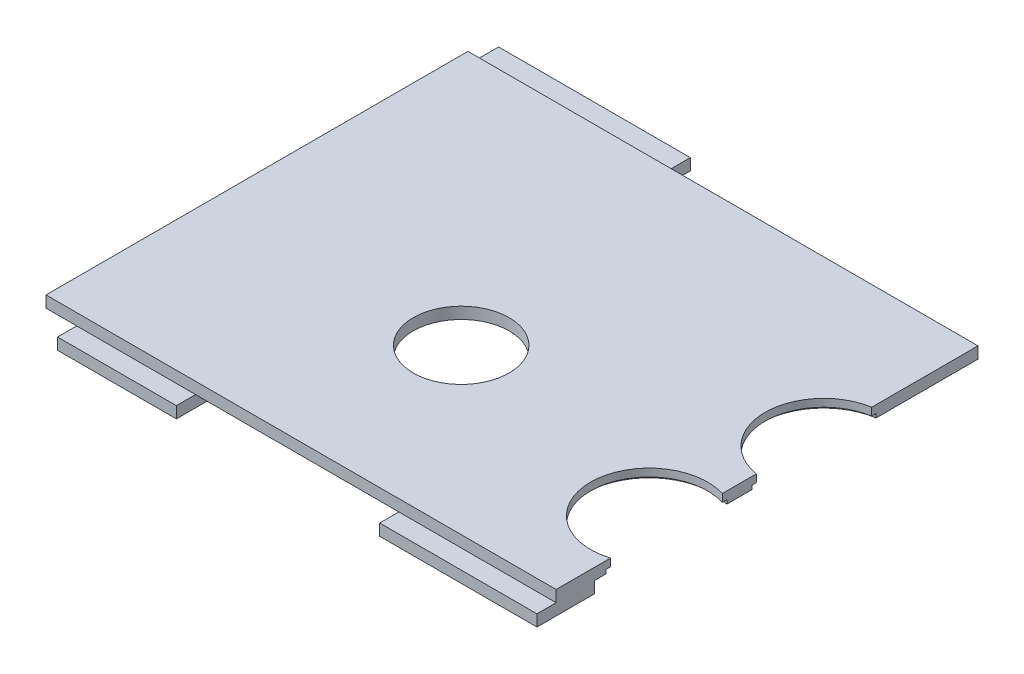
ISO-10303-21;
HEADER;
FILE_DESCRIPTION(('STEP AP214'),'2;1');
FILE_NAME('part.step','',(''),(''),'','','');
FILE_SCHEMA(('AUTOMOTIVE_DESIGN { 1 0 10303 214 1 1 1 1 }'));
ENDSEC;
DATA;
#1=APPLICATION_CONTEXT('core data for automotive mechanical design processes');
#2=APPLICATION_PROTOCOL_DEFINITION('international standard','automotive_design',2000,#1);
#3=PRODUCT_CONTEXT('',#1,'mechanical');
#4=PRODUCT('Part','Part','',(#3));
#5=PRODUCT_RELATED_PRODUCT_CATEGORY('part','',(#4));
#6=PRODUCT_DEFINITION_FORMATION('','',#4);
#7=PRODUCT_DEFINITION_CONTEXT('part definition',#1,'design');
#8=PRODUCT_DEFINITION('design','',#6,#7);
#9=PRODUCT_DEFINITION_SHAPE('','',#8);
#10=(LENGTH_UNIT() NAMED_UNIT(*) SI_UNIT(.MILLI.,.METRE.));
#11=(NAMED_UNIT(*) PLANE_ANGLE_UNIT() SI_UNIT($,.RADIAN.));
#12=(NAMED_UNIT(*) SI_UNIT($,.STERADIAN.) SOLID_ANGLE_UNIT());
#13=UNCERTAINTY_MEASURE_WITH_UNIT(LENGTH_MEASURE(1.E-05),#10,'distance_accuracy_value','');
#14=(GEOMETRIC_REPRESENTATION_CONTEXT(3) GLOBAL_UNCERTAINTY_ASSIGNED_CONTEXT((#13)) GLOBAL_UNIT_ASSIGNED_CONTEXT((#10,
#11,#12)) REPRESENTATION_CONTEXT('',''));
#15=CARTESIAN_POINT('',(0.,0.,0.));
#16=DIRECTION('',(0.,0.,1.));
#17=DIRECTION('',(1.,0.,0.));
#18=AXIS2_PLACEMENT_3D('',#15,#16,#17);
#19=CARTESIAN_POINT('',(135.5,-3.001,-67.25));
#20=DIRECTION('',(0.,1.,0.));
#21=DIRECTION('',(0.,0.,1.));
#22=AXIS2_PLACEMENT_3D('',#19,#20,#21);
#23=CYLINDRICAL_SURFACE('',#22,15.25);
#24=CARTESIAN_POINT('',(135.5,1.,-67.25));
#25=DIRECTION('',(0.,-1.,0.));
#26=DIRECTION('',(0.,0.,-1.));
#27=AXIS2_PLACEMENT_3D('',#24,#25,#26);
#28=CIRCLE('',#27,15.25);
#29=CARTESIAN_POINT('',(133.,0.999999999999998,-82.2936863833304));
#30=VERTEX_POINT('',#29);
#31=CARTESIAN_POINT('',(133.,1.,-52.2063136166696));
#32=VERTEX_POINT('',#31);
#33=EDGE_CURVE('E42',#30,#32,#28,.F.);
#34=ORIENTED_EDGE('',*,*,#33,.F.);
#35=DIRECTION('',(0.,1.,0.));
#36=VECTOR('',#35,1.);
#37=CARTESIAN_POINT('',(133.,-3.001,-82.2936863833304));
#38=LINE('',#37,#36);
#39=CARTESIAN_POINT('',(133.,3.,-82.2936863833304));
#40=VERTEX_POINT('',#39);
#41=EDGE_CURVE('E279',#30,#40,#38,.T.);
#42=ORIENTED_EDGE('',*,*,#41,.T.);
#43=CARTESIAN_POINT('',(135.5,3.,-67.25));
#44=DIRECTION('',(0.,1.,0.));
#45=DIRECTION('',(0.,0.,1.));
#46=AXIS2_PLACEMENT_3D('',#43,#44,#45);
#47=CIRCLE('',#46,15.25);
#48=CARTESIAN_POINT('',(133.,3.,-52.2063136166696));
#49=VERTEX_POINT('',#48);
#50=EDGE_CURVE('E278',#40,#49,#47,.T.);
#51=ORIENTED_EDGE('',*,*,#50,.T.);
#52=DIRECTION('',(0.,1.,0.));
#53=VECTOR('',#52,1.);
#54=CARTESIAN_POINT('',(133.,-3.001,-52.2063136166696));
#55=LINE('',#54,#53);
#56=EDGE_CURVE('E274',#49,#32,#55,.F.);
#57=ORIENTED_EDGE('',*,*,#56,.T.);
#58=EDGE_LOOP('',(#34,#42,#51,#57));
#59=FACE_BOUND('',#58,.T.);
#60=ADVANCED_FACE('F34',(#59),#23,.F.);
#61=CARTESIAN_POINT('',(128.5,-3.001,-28.75));
#62=DIRECTION('',(0.,1.,0.));
#63=DIRECTION('',(0.,0.,1.));
#64=AXIS2_PLACEMENT_3D('',#61,#62,#63);
#65=CYLINDRICAL_SURFACE('',#64,15.25);
#66=CARTESIAN_POINT('',(128.5,1.,-28.75));
#67=DIRECTION('',(0.,-1.,0.));
#68=DIRECTION('',(0.,0.,-1.));
#69=AXIS2_PLACEMENT_3D('',#66,#67,#68);
#70=CIRCLE('',#69,15.25);
#71=CARTESIAN_POINT('',(133.,0.999999999999998,-43.3209471208978));
#72=VERTEX_POINT('',#71);
#73=CARTESIAN_POINT('',(133.,1.,-14.1790528791022));
#74=VERTEX_POINT('',#73);
#75=EDGE_CURVE('E264',#72,#74,#70,.F.);
#76=ORIENTED_EDGE('',*,*,#75,.F.);
#77=DIRECTION('',(0.,1.,0.));
#78=VECTOR('',#77,1.);
#79=CARTESIAN_POINT('',(133.,-3.001,-43.3209471208978));
#80=LINE('',#79,#78);
#81=CARTESIAN_POINT('',(133.,3.,-43.3209471208978));
#82=VERTEX_POINT('',#81);
#83=EDGE_CURVE('E281',#72,#82,#80,.T.);
#84=ORIENTED_EDGE('',*,*,#83,.T.);
#85=CARTESIAN_POINT('',(128.5,3.,-28.75));
#86=DIRECTION('',(0.,1.,0.));
#87=DIRECTION('',(0.,0.,1.));
#88=AXIS2_PLACEMENT_3D('',#85,#86,#87);
#89=CIRCLE('',#88,15.25);
#90=CARTESIAN_POINT('',(133.,3.,-14.1790528791022));
#91=VERTEX_POINT('',#90);
#92=EDGE_CURVE('E551',#82,#91,#89,.T.);
#93=ORIENTED_EDGE('',*,*,#92,.T.);
#94=DIRECTION('',(0.,1.,0.));
#95=VECTOR('',#94,1.);
#96=CARTESIAN_POINT('',(133.,-3.001,-14.1790528791022));
#97=LINE('',#96,#95);
#98=EDGE_CURVE('E552',#91,#74,#97,.F.);
#99=ORIENTED_EDGE('',*,*,#98,.T.);
#100=EDGE_LOOP('',(#76,#84,#93,#99));
#101=FACE_BOUND('',#100,.T.);
#102=ADVANCED_FACE('F439',(#101),#65,.F.);
#103=CARTESIAN_POINT('',(133.,3.,0.));
#104=DIRECTION('',(-1.,0.,0.));
#105=DIRECTION('',(0.,0.,1.));
#106=AXIS2_PLACEMENT_3D('',#103,#104,#105);
#107=PLANE('',#106);
#108=DIRECTION('',(0.,0.,-1.));
#109=VECTOR('',#108,1.);
#110=CARTESIAN_POINT('',(133.,0.,0.));
#111=LINE('',#110,#109);
#112=CARTESIAN_POINT('',(133.,0.,-10.));
#113=VERTEX_POINT('',#112);
#114=CARTESIAN_POINT('',(133.,0.,-13.0054572946687));
#115=VERTEX_POINT('',#114);
#116=EDGE_CURVE('E235',#113,#115,#111,.T.);
#117=ORIENTED_EDGE('',*,*,#116,.T.);
#118=DIRECTION('',(0.,-1.,0.));
#119=VECTOR('',#118,1.);
#120=CARTESIAN_POINT('',(133.,1.,-13.0054572946687));
#121=LINE('',#120,#119);
#122=CARTESIAN_POINT('',(133.,1.,-13.0054572946687));
#123=VERTEX_POINT('',#122);
#124=EDGE_CURVE('E214',#115,#123,#121,.F.);
#125=ORIENTED_EDGE('',*,*,#124,.T.);
#126=DIRECTION('',(0.,0.,1.));
#127=VECTOR('',#126,1.);
#128=CARTESIAN_POINT('',(133.,1.,0.));
#129=LINE('',#128,#127);
#130=EDGE_CURVE('E569',#74,#123,#129,.T.);
#131=ORIENTED_EDGE('',*,*,#130,.F.);
#132=ORIENTED_EDGE('',*,*,#98,.F.);
#133=DIRECTION('',(0.,0.,-1.));
#134=VECTOR('',#133,1.);
#135=CARTESIAN_POINT('',(133.,3.,0.));
#136=LINE('',#135,#134);
#137=CARTESIAN_POINT('',(133.,3.,0.));
#138=VERTEX_POINT('',#137);
#139=EDGE_CURVE('E386',#138,#91,#136,.T.);
#140=ORIENTED_EDGE('',*,*,#139,.F.);
#141=DIRECTION('',(0.,-1.,0.));
#142=VECTOR('',#141,1.);
#143=CARTESIAN_POINT('',(133.,3.,0.));
#144=LINE('',#143,#142);
#145=CARTESIAN_POINT('',(133.,0.,0.));
#146=VERTEX_POINT('',#145);
#147=EDGE_CURVE('E254',#138,#146,#144,.T.);
#148=ORIENTED_EDGE('',*,*,#147,.T.);
#149=DIRECTION('',(0.,0.,1.));
#150=VECTOR('',#149,1.);
#151=CARTESIAN_POINT('',(133.,0.,-10.));
#152=LINE('',#151,#150);
#153=CARTESIAN_POINT('',(133.,0.,5.));
#154=VERTEX_POINT('',#153);
#155=EDGE_CURVE('E320',#146,#154,#152,.T.);
#156=ORIENTED_EDGE('',*,*,#155,.T.);
#157=DIRECTION('',(0.,1.,0.));
#158=VECTOR('',#157,1.);
#159=CARTESIAN_POINT('',(133.,-3.,5.));
#160=LINE('',#159,#158);
#161=CARTESIAN_POINT('',(133.,-3.,5.));
#162=VERTEX_POINT('',#161);
#163=EDGE_CURVE('E346',#162,#154,#160,.T.);
#164=ORIENTED_EDGE('',*,*,#163,.F.);
#165=DIRECTION('',(0.,0.,1.));
#166=VECTOR('',#165,1.);
#167=CARTESIAN_POINT('',(133.,-3.,-10.));
#168=LINE('',#167,#166);
#169=CARTESIAN_POINT('',(133.,-3.,-10.));
#170=VERTEX_POINT('',#169);
#171=EDGE_CURVE('E321',#170,#162,#168,.T.);
#172=ORIENTED_EDGE('',*,*,#171,.F.);
#173=DIRECTION('',(0.,1.,0.));
#174=VECTOR('',#173,1.);
#175=CARTESIAN_POINT('',(133.,-3.,-10.));
#176=LINE('',#175,#174);
#177=EDGE_CURVE('E331',#170,#113,#176,.T.);
#178=ORIENTED_EDGE('',*,*,#177,.T.);
#179=EDGE_LOOP('',(#117,#125,#131,#132,#140,#148,#156,#164,#172,#178));
#180=FACE_BOUND('',#179,.T.);
#181=ADVANCED_FACE('F445',(#180),#107,.F.);
#182=DIRECTION('',(0.,0.,1.));
#183=VECTOR('',#182,1.);
#184=CARTESIAN_POINT('',(133.,1.,0.));
#185=LINE('',#184,#183);
#186=CARTESIAN_POINT('',(133.,1.,-44.4945427053313));
#187=VERTEX_POINT('',#186);
#188=EDGE_CURVE('E57',#187,#72,#185,.T.);
#189=ORIENTED_EDGE('',*,*,#188,.F.);
#190=DIRECTION('',(0.,-1.,0.));
#191=VECTOR('',#190,1.);
#192=CARTESIAN_POINT('',(133.,1.,-44.4945427053313));
#193=LINE('',#192,#191);
#194=CARTESIAN_POINT('',(133.,0.,-44.4945427053313));
#195=VERTEX_POINT('',#194);
#196=EDGE_CURVE('E212',#187,#195,#193,.T.);
#197=ORIENTED_EDGE('',*,*,#196,.T.);
#198=CARTESIAN_POINT('',(133.,0.,-51.0669649014779));
#199=VERTEX_POINT('',#198);
#200=EDGE_CURVE('E226',#195,#199,#111,.T.);
#201=ORIENTED_EDGE('',*,*,#200,.T.);
#202=DIRECTION('',(0.,-1.,0.));
#203=VECTOR('',#202,1.);
#204=CARTESIAN_POINT('',(133.,1.,-51.0669649014779));
#205=LINE('',#204,#203);
#206=CARTESIAN_POINT('',(133.,1.,-51.0669649014779));
#207=VERTEX_POINT('',#206);
#208=EDGE_CURVE('E228',#199,#207,#205,.F.);
#209=ORIENTED_EDGE('',*,*,#208,.T.);
#210=DIRECTION('',(0.,0.,1.));
#211=VECTOR('',#210,1.);
#212=CARTESIAN_POINT('',(133.,1.,0.));
#213=LINE('',#212,#211);
#214=EDGE_CURVE('E267',#32,#207,#213,.T.);
#215=ORIENTED_EDGE('',*,*,#214,.F.);
#216=ORIENTED_EDGE('',*,*,#56,.F.);
#217=EDGE_CURVE('E389',#82,#49,#136,.T.);
#218=ORIENTED_EDGE('',*,*,#217,.F.);
#219=ORIENTED_EDGE('',*,*,#83,.F.);
#220=EDGE_LOOP('',(#189,#197,#201,#209,#215,#216,#218,#219));
#221=FACE_BOUND('',#220,.T.);
#222=ADVANCED_FACE('F224',(#221),#107,.F.);
#223=CARTESIAN_POINT('',(0.,0.,0.));
#224=DIRECTION('',(0.,-1.,0.));
#225=DIRECTION('',(0.,0.,-1.));
#226=AXIS2_PLACEMENT_3D('',#223,#224,#225);
#227=PLANE('',#226);
#228=CARTESIAN_POINT('',(128.5,0.,-28.75));
#229=DIRECTION('',(0.,-1.,0.));
#230=DIRECTION('',(0.,0.,-1.));
#231=AXIS2_PLACEMENT_3D('',#228,#229,#230);
#232=CIRCLE('',#231,16.375);
#233=EDGE_CURVE('E208',#115,#195,#232,.T.);
#234=ORIENTED_EDGE('',*,*,#233,.F.);
#235=ORIENTED_EDGE('',*,*,#116,.F.);
#236=DIRECTION('',(1.,0.,0.));
#237=VECTOR('',#236,1.);
#238=CARTESIAN_POINT('',(133.,0.,-10.));
#239=LINE('',#238,#237);
#240=CARTESIAN_POINT('',(92.,0.,-10.));
#241=VERTEX_POINT('',#240);
#242=EDGE_CURVE('E325',#241,#113,#239,.T.);
#243=ORIENTED_EDGE('',*,*,#242,.F.);
#244=DIRECTION('',(0.,0.,1.));
#245=VECTOR('',#244,1.);
#246=CARTESIAN_POINT('',(92.,0.,0.));
#247=LINE('',#246,#245);
#248=CARTESIAN_POINT('',(92.,0.,0.));
#249=VERTEX_POINT('',#248);
#250=EDGE_CURVE('E261',#241,#249,#247,.T.);
#251=ORIENTED_EDGE('',*,*,#250,.T.);
#252=DIRECTION('',(1.,0.,0.));
#253=VECTOR('',#252,1.);
#254=CARTESIAN_POINT('',(0.,0.,0.));
#255=LINE('',#254,#253);
#256=CARTESIAN_POINT('',(39.,0.,0.));
#257=VERTEX_POINT('',#256);
#258=EDGE_CURVE('E395',#257,#249,#255,.T.);
#259=ORIENTED_EDGE('',*,*,#258,.F.);
#260=DIRECTION('',(0.,0.,1.));
#261=VECTOR('',#260,1.);
#262=CARTESIAN_POINT('',(39.,0.,-10.));
#263=LINE('',#262,#261);
#264=CARTESIAN_POINT('',(39.,0.,-10.));
#265=VERTEX_POINT('',#264);
#266=EDGE_CURVE('E290',#265,#257,#263,.T.);
#267=ORIENTED_EDGE('',*,*,#266,.F.);
#268=DIRECTION('',(1.,0.,0.));
#269=VECTOR('',#268,1.);
#270=CARTESIAN_POINT('',(39.,0.,-10.));
#271=LINE('',#270,#269);
#272=CARTESIAN_POINT('',(8.00000000000001,0.,-10.));
#273=VERTEX_POINT('',#272);
#274=EDGE_CURVE('E305',#273,#265,#271,.T.);
#275=ORIENTED_EDGE('',*,*,#274,.F.);
#276=DIRECTION('',(0.,0.,-1.));
#277=VECTOR('',#276,1.);
#278=CARTESIAN_POINT('',(8.00000000000001,0.,-10.));
#279=LINE('',#278,#277);
#280=CARTESIAN_POINT('',(8.00000000000001,0.,0.));
#281=VERTEX_POINT('',#280);
#282=EDGE_CURVE('E300',#281,#273,#279,.T.);
#283=ORIENTED_EDGE('',*,*,#282,.F.);
#284=CARTESIAN_POINT('',(0.,0.,0.));
#285=VERTEX_POINT('',#284);
#286=EDGE_CURVE('E239',#285,#281,#255,.T.);
#287=ORIENTED_EDGE('',*,*,#286,.F.);
#288=DIRECTION('',(0.,0.,1.));
#289=VECTOR('',#288,1.);
#290=CARTESIAN_POINT('',(0.,0.,0.));
#291=LINE('',#290,#289);
#292=CARTESIAN_POINT('',(0.,0.,-100.));
#293=VERTEX_POINT('',#292);
#294=EDGE_CURVE('E380',#293,#285,#291,.T.);
#295=ORIENTED_EDGE('',*,*,#294,.F.);
#296=DIRECTION('',(-1.,0.,0.));
#297=VECTOR('',#296,1.);
#298=CARTESIAN_POINT('',(0.,0.,-100.));
#299=LINE('',#298,#297);
#300=CARTESIAN_POINT('',(50.,0.,-100.));
#301=VERTEX_POINT('',#300);
#302=EDGE_CURVE('E354',#301,#293,#299,.T.);
#303=ORIENTED_EDGE('',*,*,#302,.F.);
#304=DIRECTION('',(0.,0.,1.));
#305=VECTOR('',#304,1.);
#306=CARTESIAN_POINT('',(50.,0.,-118.));
#307=LINE('',#306,#305);
#308=CARTESIAN_POINT('',(50.,0.,-110.));
#309=VERTEX_POINT('',#308);
#310=EDGE_CURVE('E260',#309,#301,#307,.T.);
#311=ORIENTED_EDGE('',*,*,#310,.F.);
#312=DIRECTION('',(-1.,0.,0.));
#313=VECTOR('',#312,1.);
#314=CARTESIAN_POINT('',(0.,0.,-110.));
#315=LINE('',#314,#313);
#316=CARTESIAN_POINT('',(133.,0.,-110.));
#317=VERTEX_POINT('',#316);
#318=EDGE_CURVE('E243',#317,#309,#315,.T.);
#319=ORIENTED_EDGE('',*,*,#318,.F.);
#320=CARTESIAN_POINT('',(133.,0.,-83.4330350985222));
#321=VERTEX_POINT('',#320);
#322=EDGE_CURVE('E236',#321,#317,#111,.T.);
#323=ORIENTED_EDGE('',*,*,#322,.F.);
#324=CARTESIAN_POINT('',(135.5,0.,-67.25));
#325=DIRECTION('',(0.,-1.,0.));
#326=DIRECTION('',(0.,0.,-1.));
#327=AXIS2_PLACEMENT_3D('',#324,#325,#326);
#328=CIRCLE('',#327,16.375);
#329=EDGE_CURVE('E234',#199,#321,#328,.T.);
#330=ORIENTED_EDGE('',*,*,#329,.F.);
#331=ORIENTED_EDGE('',*,*,#200,.F.);
#332=EDGE_LOOP('',(#234,#235,#243,#251,#259,#267,#275,#283,#287,#295,#303,#311,#319,#323,#330,#331));
#333=FACE_BOUND('',#332,.T.);
#334=CARTESIAN_POINT('',(65.5,0.,-42.75));
#335=DIRECTION('',(0.,-1.,0.));
#336=DIRECTION('',(0.,0.,-1.));
#337=AXIS2_PLACEMENT_3D('',#334,#335,#336);
#338=CIRCLE('',#337,12.5);
#339=CARTESIAN_POINT('',(65.5,0.,-55.25));
#340=VERTEX_POINT('',#339);
#341=EDGE_CURVE('E557',#340,#340,#338,.F.);
#342=ORIENTED_EDGE('',*,*,#341,.T.);
#343=EDGE_LOOP('',(#342));
#344=FACE_BOUND('',#343,.T.);
#345=ADVANCED_FACE('F231',(#333,#344),#227,.T.);
#346=CARTESIAN_POINT('',(0.,3.,0.));
#347=DIRECTION('',(1.,0.,0.));
#348=DIRECTION('',(0.,0.,-1.));
#349=AXIS2_PLACEMENT_3D('',#346,#347,#348);
#350=PLANE('',#349);
#351=DIRECTION('',(0.,-1.,0.));
#352=VECTOR('',#351,1.);
#353=CARTESIAN_POINT('',(0.,3.,-110.));
#354=LINE('',#353,#352);
#355=CARTESIAN_POINT('',(0.,3.,-110.));
#356=VERTEX_POINT('',#355);
#357=CARTESIAN_POINT('',(0.,0.,-110.));
#358=VERTEX_POINT('',#357);
#359=EDGE_CURVE('E247',#356,#358,#354,.T.);
#360=ORIENTED_EDGE('',*,*,#359,.T.);
#361=DIRECTION('',(0.,0.,-1.));
#362=VECTOR('',#361,1.);
#363=CARTESIAN_POINT('',(0.,0.,-118.));
#364=LINE('',#363,#362);
#365=CARTESIAN_POINT('',(0.,0.,-118.));
#366=VERTEX_POINT('',#365);
#367=EDGE_CURVE('E349',#358,#366,#364,.T.);
#368=ORIENTED_EDGE('',*,*,#367,.T.);
#369=DIRECTION('',(0.,1.,0.));
#370=VECTOR('',#369,1.);
#371=CARTESIAN_POINT('',(0.,-3.,-118.));
#372=LINE('',#371,#370);
#373=CARTESIAN_POINT('',(0.,-3.,-118.));
#374=VERTEX_POINT('',#373);
#375=EDGE_CURVE('E377',#374,#366,#372,.T.);
#376=ORIENTED_EDGE('',*,*,#375,.F.);
#377=DIRECTION('',(0.,0.,-1.));
#378=VECTOR('',#377,1.);
#379=CARTESIAN_POINT('',(0.,-3.,-118.));
#380=LINE('',#379,#378);
#381=CARTESIAN_POINT('',(0.,-3.,-100.));
#382=VERTEX_POINT('',#381);
#383=EDGE_CURVE('E350',#382,#374,#380,.T.);
#384=ORIENTED_EDGE('',*,*,#383,.F.);
#385=DIRECTION('',(0.,1.,0.));
#386=VECTOR('',#385,1.);
#387=CARTESIAN_POINT('',(0.,-3.,-100.));
#388=LINE('',#387,#386);
#389=EDGE_CURVE('E360',#382,#293,#388,.T.);
#390=ORIENTED_EDGE('',*,*,#389,.T.);
#391=ORIENTED_EDGE('',*,*,#294,.T.);
#392=DIRECTION('',(0.,-1.,0.));
#393=VECTOR('',#392,1.);
#394=CARTESIAN_POINT('',(0.,3.,0.));
#395=LINE('',#394,#393);
#396=CARTESIAN_POINT('',(0.,3.,0.));
#397=VERTEX_POINT('',#396);
#398=EDGE_CURVE('E257',#397,#285,#395,.T.);
#399=ORIENTED_EDGE('',*,*,#398,.F.);
#400=DIRECTION('',(0.,0.,1.));
#401=VECTOR('',#400,1.);
#402=CARTESIAN_POINT('',(0.,3.,0.));
#403=LINE('',#402,#401);
#404=EDGE_CURVE('E246',#356,#397,#403,.T.);
#405=ORIENTED_EDGE('',*,*,#404,.F.);
#406=EDGE_LOOP('',(#360,#368,#376,#384,#390,#391,#399,#405));
#407=FACE_BOUND('',#406,.T.);
#408=ADVANCED_FACE('F36',(#407),#350,.F.);
#409=CARTESIAN_POINT('',(0.,3.,0.));
#410=DIRECTION('',(0.,0.,-1.));
#411=DIRECTION('',(-1.,0.,0.));
#412=AXIS2_PLACEMENT_3D('',#409,#410,#411);
#413=PLANE('',#412);
#414=ORIENTED_EDGE('',*,*,#286,.T.);
#415=EDGE_CURVE('E396',#281,#257,#255,.T.);
#416=ORIENTED_EDGE('',*,*,#415,.T.);
#417=ORIENTED_EDGE('',*,*,#258,.T.);
#418=EDGE_CURVE('E390',#249,#146,#255,.T.);
#419=ORIENTED_EDGE('',*,*,#418,.T.);
#420=ORIENTED_EDGE('',*,*,#147,.F.);
#421=DIRECTION('',(1.,0.,0.));
#422=VECTOR('',#421,1.);
#423=CARTESIAN_POINT('',(0.,3.,0.));
#424=LINE('',#423,#422);
#425=EDGE_CURVE('E383',#397,#138,#424,.T.);
#426=ORIENTED_EDGE('',*,*,#425,.F.);
#427=ORIENTED_EDGE('',*,*,#398,.T.);
#428=EDGE_LOOP('',(#414,#416,#417,#419,#420,#426,#427));
#429=FACE_BOUND('',#428,.T.);
#430=ADVANCED_FACE('F402',(#429),#413,.F.);
#431=DIRECTION('',(0.,0.,1.));
#432=VECTOR('',#431,1.);
#433=CARTESIAN_POINT('',(133.,1.,0.));
#434=LINE('',#433,#432);
#435=CARTESIAN_POINT('',(133.,1.,-83.4330350985222));
#436=VERTEX_POINT('',#435);
#437=EDGE_CURVE('E49',#436,#30,#434,.T.);
#438=ORIENTED_EDGE('',*,*,#437,.F.);
#439=DIRECTION('',(0.,-1.,0.));
#440=VECTOR('',#439,1.);
#441=CARTESIAN_POINT('',(133.,1.,-83.4330350985222));
#442=LINE('',#441,#440);
#443=EDGE_CURVE('E11',#436,#321,#442,.T.);
#444=ORIENTED_EDGE('',*,*,#443,.T.);
#445=ORIENTED_EDGE('',*,*,#322,.T.);
#446=DIRECTION('',(0.,-1.,0.));
#447=VECTOR('',#446,1.);
#448=CARTESIAN_POINT('',(133.,3.,-110.));
#449=LINE('',#448,#447);
#450=CARTESIAN_POINT('',(133.,3.,-110.));
#451=VERTEX_POINT('',#450);
#452=EDGE_CURVE('E250',#451,#317,#449,.T.);
#453=ORIENTED_EDGE('',*,*,#452,.F.);
#454=EDGE_CURVE('E385',#40,#451,#136,.T.);
#455=ORIENTED_EDGE('',*,*,#454,.F.);
#456=ORIENTED_EDGE('',*,*,#41,.F.);
#457=EDGE_LOOP('',(#438,#444,#445,#453,#455,#456));
#458=FACE_BOUND('',#457,.T.);
#459=ADVANCED_FACE('F523',(#458),#107,.F.);
#460=CARTESIAN_POINT('',(0.,3.,-110.));
#461=DIRECTION('',(0.,0.,1.));
#462=DIRECTION('',(1.,0.,0.));
#463=AXIS2_PLACEMENT_3D('',#460,#461,#462);
#464=PLANE('',#463);
#465=ORIENTED_EDGE('',*,*,#318,.T.);
#466=EDGE_CURVE('E238',#309,#358,#315,.T.);
#467=ORIENTED_EDGE('',*,*,#466,.T.);
#468=ORIENTED_EDGE('',*,*,#359,.F.);
#469=DIRECTION('',(-1.,0.,0.));
#470=VECTOR('',#469,1.);
#471=CARTESIAN_POINT('',(0.,3.,-110.));
#472=LINE('',#471,#470);
#473=EDGE_CURVE('E251',#451,#356,#472,.T.);
#474=ORIENTED_EDGE('',*,*,#473,.F.);
#475=ORIENTED_EDGE('',*,*,#452,.T.);
#476=EDGE_LOOP('',(#465,#467,#468,#474,#475));
#477=FACE_BOUND('',#476,.T.);
#478=ADVANCED_FACE('F529',(#477),#464,.F.);
#479=CARTESIAN_POINT('',(0.,3.,0.));
#480=DIRECTION('',(0.,-1.,0.));
#481=DIRECTION('',(0.,0.,-1.));
#482=AXIS2_PLACEMENT_3D('',#479,#480,#481);
#483=PLANE('',#482);
#484=CARTESIAN_POINT('',(65.5,3.,-42.75));
#485=DIRECTION('',(0.,1.,0.));
#486=DIRECTION('',(0.,0.,1.));
#487=AXIS2_PLACEMENT_3D('',#484,#485,#486);
#488=CIRCLE('',#487,12.5);
#489=CARTESIAN_POINT('',(65.5,3.,-30.25));
#490=VERTEX_POINT('',#489);
#491=EDGE_CURVE('E301',#490,#490,#488,.T.);
#492=ORIENTED_EDGE('',*,*,#491,.F.);
#493=EDGE_LOOP('',(#492));
#494=FACE_BOUND('',#493,.T.);
#495=ORIENTED_EDGE('',*,*,#139,.T.);
#496=ORIENTED_EDGE('',*,*,#92,.F.);
#497=ORIENTED_EDGE('',*,*,#217,.T.);
#498=ORIENTED_EDGE('',*,*,#50,.F.);
#499=ORIENTED_EDGE('',*,*,#454,.T.);
#500=ORIENTED_EDGE('',*,*,#473,.T.);
#501=ORIENTED_EDGE('',*,*,#404,.T.);
#502=ORIENTED_EDGE('',*,*,#425,.T.);
#503=EDGE_LOOP('',(#495,#496,#497,#498,#499,#500,#501,#502));
#504=FACE_BOUND('',#503,.T.);
#505=ADVANCED_FACE('F548',(#494,#504),#483,.F.);
#506=CARTESIAN_POINT('',(0.,0.,0.));
#507=DIRECTION('',(0.,1.,0.));
#508=DIRECTION('',(0.,0.,1.));
#509=AXIS2_PLACEMENT_3D('',#506,#507,#508);
#510=PLANE('',#509);
#511=ORIENTED_EDGE('',*,*,#466,.F.);
#512=CARTESIAN_POINT('',(50.,0.,-118.));
#513=VERTEX_POINT('',#512);
#514=EDGE_CURVE('E364',#513,#309,#307,.T.);
#515=ORIENTED_EDGE('',*,*,#514,.F.);
#516=DIRECTION('',(1.,0.,0.));
#517=VECTOR('',#516,1.);
#518=CARTESIAN_POINT('',(0.,0.,-118.));
#519=LINE('',#518,#517);
#520=EDGE_CURVE('E362',#366,#513,#519,.T.);
#521=ORIENTED_EDGE('',*,*,#520,.F.);
#522=ORIENTED_EDGE('',*,*,#367,.F.);
#523=EDGE_LOOP('',(#511,#515,#521,#522));
#524=FACE_BOUND('',#523,.T.);
#525=ADVANCED_FACE('F535',(#524),#510,.T.);
#526=CARTESIAN_POINT('',(0.,-3.,-118.));
#527=DIRECTION('',(0.,0.,1.));
#528=DIRECTION('',(1.,0.,0.));
#529=AXIS2_PLACEMENT_3D('',#526,#527,#528);
#530=PLANE('',#529);
#531=ORIENTED_EDGE('',*,*,#520,.T.);
#532=DIRECTION('',(0.,1.,0.));
#533=VECTOR('',#532,1.);
#534=CARTESIAN_POINT('',(50.,-3.,-118.));
#535=LINE('',#534,#533);
#536=CARTESIAN_POINT('',(50.,-3.,-118.));
#537=VERTEX_POINT('',#536);
#538=EDGE_CURVE('E374',#537,#513,#535,.T.);
#539=ORIENTED_EDGE('',*,*,#538,.F.);
#540=DIRECTION('',(1.,0.,0.));
#541=VECTOR('',#540,1.);
#542=CARTESIAN_POINT('',(0.,-3.,-118.));
#543=LINE('',#542,#541);
#544=EDGE_CURVE('E353',#374,#537,#543,.T.);
#545=ORIENTED_EDGE('',*,*,#544,.F.);
#546=ORIENTED_EDGE('',*,*,#375,.T.);
#547=EDGE_LOOP('',(#531,#539,#545,#546));
#548=FACE_BOUND('',#547,.T.);
#549=ADVANCED_FACE('F543',(#548),#530,.F.);
#550=CARTESIAN_POINT('',(50.,-3.,-118.));
#551=DIRECTION('',(-1.,0.,0.));
#552=DIRECTION('',(0.,0.,1.));
#553=AXIS2_PLACEMENT_3D('',#550,#551,#552);
#554=PLANE('',#553);
#555=ORIENTED_EDGE('',*,*,#514,.T.);
#556=ORIENTED_EDGE('',*,*,#310,.T.);
#557=DIRECTION('',(0.,1.,0.));
#558=VECTOR('',#557,1.);
#559=CARTESIAN_POINT('',(50.,-3.,-100.));
#560=LINE('',#559,#558);
#561=CARTESIAN_POINT('',(50.,-3.,-100.));
#562=VERTEX_POINT('',#561);
#563=EDGE_CURVE('E371',#562,#301,#560,.T.);
#564=ORIENTED_EDGE('',*,*,#563,.F.);
#565=DIRECTION('',(0.,0.,1.));
#566=VECTOR('',#565,1.);
#567=CARTESIAN_POINT('',(50.,-3.,-118.));
#568=LINE('',#567,#566);
#569=EDGE_CURVE('E356',#537,#562,#568,.T.);
#570=ORIENTED_EDGE('',*,*,#569,.F.);
#571=ORIENTED_EDGE('',*,*,#538,.T.);
#572=EDGE_LOOP('',(#555,#556,#564,#570,#571));
#573=FACE_BOUND('',#572,.T.);
#574=ADVANCED_FACE('F538',(#573),#554,.F.);
#575=CARTESIAN_POINT('',(0.,-3.,-100.));
#576=DIRECTION('',(0.,0.,-1.));
#577=DIRECTION('',(-1.,0.,0.));
#578=AXIS2_PLACEMENT_3D('',#575,#576,#577);
#579=PLANE('',#578);
#580=ORIENTED_EDGE('',*,*,#302,.T.);
#581=ORIENTED_EDGE('',*,*,#389,.F.);
#582=DIRECTION('',(-1.,0.,0.));
#583=VECTOR('',#582,1.);
#584=CARTESIAN_POINT('',(0.,-3.,-100.));
#585=LINE('',#584,#583);
#586=EDGE_CURVE('E358',#562,#382,#585,.T.);
#587=ORIENTED_EDGE('',*,*,#586,.F.);
#588=ORIENTED_EDGE('',*,*,#563,.T.);
#589=EDGE_LOOP('',(#580,#581,#587,#588));
#590=FACE_BOUND('',#589,.T.);
#591=ADVANCED_FACE('F611',(#590),#579,.F.);
#592=CARTESIAN_POINT('',(0.,-3.,0.));
#593=DIRECTION('',(0.,1.,0.));
#594=DIRECTION('',(0.,0.,1.));
#595=AXIS2_PLACEMENT_3D('',#592,#593,#594);
#596=PLANE('',#595);
#597=ORIENTED_EDGE('',*,*,#383,.T.);
#598=ORIENTED_EDGE('',*,*,#544,.T.);
#599=ORIENTED_EDGE('',*,*,#569,.T.);
#600=ORIENTED_EDGE('',*,*,#586,.T.);
#601=EDGE_LOOP('',(#597,#598,#599,#600));
#602=FACE_BOUND('',#601,.T.);
#603=ADVANCED_FACE('F603',(#602),#596,.F.);
#604=CARTESIAN_POINT('',(0.,0.,0.));
#605=DIRECTION('',(0.,-1.,0.));
#606=DIRECTION('',(0.,0.,-1.));
#607=AXIS2_PLACEMENT_3D('',#604,#605,#606);
#608=PLANE('',#607);
#609=ORIENTED_EDGE('',*,*,#155,.F.);
#610=ORIENTED_EDGE('',*,*,#418,.F.);
#611=DIRECTION('',(0.,0.,-1.));
#612=VECTOR('',#611,1.);
#613=CARTESIAN_POINT('',(92.,0.,-10.));
#614=LINE('',#613,#612);
#615=CARTESIAN_POINT('',(92.,0.,4.99999999999999));
#616=VERTEX_POINT('',#615);
#617=EDGE_CURVE('E335',#616,#249,#614,.T.);
#618=ORIENTED_EDGE('',*,*,#617,.F.);
#619=DIRECTION('',(-1.,0.,0.));
#620=VECTOR('',#619,1.);
#621=CARTESIAN_POINT('',(133.,0.,5.));
#622=LINE('',#621,#620);
#623=EDGE_CURVE('E333',#154,#616,#622,.T.);
#624=ORIENTED_EDGE('',*,*,#623,.F.);
#625=EDGE_LOOP('',(#609,#610,#618,#624));
#626=FACE_BOUND('',#625,.T.);
#627=ADVANCED_FACE('F590',(#626),#608,.F.);
#628=CARTESIAN_POINT('',(133.,-3.,5.));
#629=DIRECTION('',(0.,0.,-1.));
#630=DIRECTION('',(-1.,0.,0.));
#631=AXIS2_PLACEMENT_3D('',#628,#629,#630);
#632=PLANE('',#631);
#633=ORIENTED_EDGE('',*,*,#623,.T.);
#634=DIRECTION('',(0.,1.,0.));
#635=VECTOR('',#634,1.);
#636=CARTESIAN_POINT('',(92.,-3.,4.99999999999999));
#637=LINE('',#636,#635);
#638=CARTESIAN_POINT('',(92.,-3.,4.99999999999999));
#639=VERTEX_POINT('',#638);
#640=EDGE_CURVE('E343',#639,#616,#637,.T.);
#641=ORIENTED_EDGE('',*,*,#640,.F.);
#642=DIRECTION('',(-1.,0.,0.));
#643=VECTOR('',#642,1.);
#644=CARTESIAN_POINT('',(133.,-3.,5.));
#645=LINE('',#644,#643);
#646=EDGE_CURVE('E324',#162,#639,#645,.T.);
#647=ORIENTED_EDGE('',*,*,#646,.F.);
#648=ORIENTED_EDGE('',*,*,#163,.T.);
#649=EDGE_LOOP('',(#633,#641,#647,#648));
#650=FACE_BOUND('',#649,.T.);
#651=ADVANCED_FACE('F594',(#650),#632,.F.);
#652=CARTESIAN_POINT('',(92.,-3.,-10.));
#653=DIRECTION('',(1.,0.,0.));
#654=DIRECTION('',(0.,0.,-1.));
#655=AXIS2_PLACEMENT_3D('',#652,#653,#654);
#656=PLANE('',#655);
#657=ORIENTED_EDGE('',*,*,#617,.T.);
#658=ORIENTED_EDGE('',*,*,#250,.F.);
#659=DIRECTION('',(0.,1.,0.));
#660=VECTOR('',#659,1.);
#661=CARTESIAN_POINT('',(92.,-3.,-10.));
#662=LINE('',#661,#660);
#663=CARTESIAN_POINT('',(92.,-3.,-10.));
#664=VERTEX_POINT('',#663);
#665=EDGE_CURVE('E341',#664,#241,#662,.T.);
#666=ORIENTED_EDGE('',*,*,#665,.F.);
#667=DIRECTION('',(0.,0.,-1.));
#668=VECTOR('',#667,1.);
#669=CARTESIAN_POINT('',(92.,-3.,-10.));
#670=LINE('',#669,#668);
#671=EDGE_CURVE('E327',#639,#664,#670,.T.);
#672=ORIENTED_EDGE('',*,*,#671,.F.);
#673=ORIENTED_EDGE('',*,*,#640,.T.);
#674=EDGE_LOOP('',(#657,#658,#666,#672,#673));
#675=FACE_BOUND('',#674,.T.);
#676=ADVANCED_FACE('F585',(#675),#656,.F.);
#677=CARTESIAN_POINT('',(133.,-3.,-10.));
#678=DIRECTION('',(0.,0.,1.));
#679=DIRECTION('',(1.,0.,0.));
#680=AXIS2_PLACEMENT_3D('',#677,#678,#679);
#681=PLANE('',#680);
#682=ORIENTED_EDGE('',*,*,#242,.T.);
#683=ORIENTED_EDGE('',*,*,#177,.F.);
#684=DIRECTION('',(1.,0.,0.));
#685=VECTOR('',#684,1.);
#686=CARTESIAN_POINT('',(133.,-3.,-10.));
#687=LINE('',#686,#685);
#688=EDGE_CURVE('E329',#664,#170,#687,.T.);
#689=ORIENTED_EDGE('',*,*,#688,.F.);
#690=ORIENTED_EDGE('',*,*,#665,.T.);
#691=EDGE_LOOP('',(#682,#683,#689,#690));
#692=FACE_BOUND('',#691,.T.);
#693=ADVANCED_FACE('F580',(#692),#681,.F.);
#694=CARTESIAN_POINT('',(0.,-3.,0.));
#695=DIRECTION('',(0.,-1.,0.));
#696=DIRECTION('',(0.,0.,-1.));
#697=AXIS2_PLACEMENT_3D('',#694,#695,#696);
#698=PLANE('',#697);
#699=ORIENTED_EDGE('',*,*,#171,.T.);
#700=ORIENTED_EDGE('',*,*,#646,.T.);
#701=ORIENTED_EDGE('',*,*,#671,.T.);
#702=ORIENTED_EDGE('',*,*,#688,.T.);
#703=EDGE_LOOP('',(#699,#700,#701,#702));
#704=FACE_BOUND('',#703,.T.);
#705=ADVANCED_FACE('F435',(#704),#698,.T.);
#706=CARTESIAN_POINT('',(0.,0.,0.));
#707=DIRECTION('',(0.,1.,0.));
#708=DIRECTION('',(0.,0.,1.));
#709=AXIS2_PLACEMENT_3D('',#706,#707,#708);
#710=PLANE('',#709);
#711=ORIENTED_EDGE('',*,*,#415,.F.);
#712=CARTESIAN_POINT('',(8.00000000000001,0.,4.99999999999998));
#713=VERTEX_POINT('',#712);
#714=EDGE_CURVE('E302',#713,#281,#279,.T.);
#715=ORIENTED_EDGE('',*,*,#714,.F.);
#716=DIRECTION('',(-1.,0.,0.));
#717=VECTOR('',#716,1.);
#718=CARTESIAN_POINT('',(39.,0.,4.99999999999999));
#719=LINE('',#718,#717);
#720=CARTESIAN_POINT('',(39.,0.,4.99999999999999));
#721=VERTEX_POINT('',#720);
#722=EDGE_CURVE('E297',#721,#713,#719,.T.);
#723=ORIENTED_EDGE('',*,*,#722,.F.);
#724=EDGE_CURVE('E307',#257,#721,#263,.T.);
#725=ORIENTED_EDGE('',*,*,#724,.F.);
#726=EDGE_LOOP('',(#711,#715,#723,#725));
#727=FACE_BOUND('',#726,.T.);
#728=ADVANCED_FACE('F406',(#727),#710,.T.);
#729=CARTESIAN_POINT('',(39.,-3.,4.99999999999999));
#730=DIRECTION('',(0.,0.,-1.));
#731=DIRECTION('',(-1.,0.,0.));
#732=AXIS2_PLACEMENT_3D('',#729,#730,#731);
#733=PLANE('',#732);
#734=ORIENTED_EDGE('',*,*,#722,.T.);
#735=DIRECTION('',(0.,1.,0.));
#736=VECTOR('',#735,1.);
#737=CARTESIAN_POINT('',(8.00000000000001,-3.,4.99999999999998));
#738=LINE('',#737,#736);
#739=CARTESIAN_POINT('',(8.00000000000001,-3.,4.99999999999998));
#740=VERTEX_POINT('',#739);
#741=EDGE_CURVE('E317',#740,#713,#738,.T.);
#742=ORIENTED_EDGE('',*,*,#741,.F.);
#743=DIRECTION('',(-1.,0.,0.));
#744=VECTOR('',#743,1.);
#745=CARTESIAN_POINT('',(39.,-3.,4.99999999999999));
#746=LINE('',#745,#744);
#747=CARTESIAN_POINT('',(39.,-3.,4.99999999999999));
#748=VERTEX_POINT('',#747);
#749=EDGE_CURVE('E286',#748,#740,#746,.T.);
#750=ORIENTED_EDGE('',*,*,#749,.F.);
#751=DIRECTION('',(0.,1.,0.));
#752=VECTOR('',#751,1.);
#753=CARTESIAN_POINT('',(39.,-3.,4.99999999999999));
#754=LINE('',#753,#752);
#755=EDGE_CURVE('E296',#748,#721,#754,.T.);
#756=ORIENTED_EDGE('',*,*,#755,.T.);
#757=EDGE_LOOP('',(#734,#742,#750,#756));
#758=FACE_BOUND('',#757,.T.);
#759=ADVANCED_FACE('F427',(#758),#733,.F.);
#760=CARTESIAN_POINT('',(8.00000000000001,-3.,-10.));
#761=DIRECTION('',(1.,0.,0.));
#762=DIRECTION('',(0.,0.,-1.));
#763=AXIS2_PLACEMENT_3D('',#760,#761,#762);
#764=PLANE('',#763);
#765=ORIENTED_EDGE('',*,*,#714,.T.);
#766=ORIENTED_EDGE('',*,*,#282,.T.);
#767=DIRECTION('',(0.,1.,0.));
#768=VECTOR('',#767,1.);
#769=CARTESIAN_POINT('',(8.00000000000001,-3.,-10.));
#770=LINE('',#769,#768);
#771=CARTESIAN_POINT('',(8.00000000000001,-3.,-10.));
#772=VERTEX_POINT('',#771);
#773=EDGE_CURVE('E314',#772,#273,#770,.T.);
#774=ORIENTED_EDGE('',*,*,#773,.F.);
#775=DIRECTION('',(0.,0.,-1.));
#776=VECTOR('',#775,1.);
#777=CARTESIAN_POINT('',(8.00000000000001,-3.,-10.));
#778=LINE('',#777,#776);
#779=EDGE_CURVE('E289',#740,#772,#778,.T.);
#780=ORIENTED_EDGE('',*,*,#779,.F.);
#781=ORIENTED_EDGE('',*,*,#741,.T.);
#782=EDGE_LOOP('',(#765,#766,#774,#780,#781));
#783=FACE_BOUND('',#782,.T.);
#784=ADVANCED_FACE('F410',(#783),#764,.F.);
#785=CARTESIAN_POINT('',(39.,-3.,-10.));
#786=DIRECTION('',(0.,0.,1.));
#787=DIRECTION('',(1.,0.,0.));
#788=AXIS2_PLACEMENT_3D('',#785,#786,#787);
#789=PLANE('',#788);
#790=ORIENTED_EDGE('',*,*,#274,.T.);
#791=DIRECTION('',(0.,1.,0.));
#792=VECTOR('',#791,1.);
#793=CARTESIAN_POINT('',(39.,-3.,-10.));
#794=LINE('',#793,#792);
#795=CARTESIAN_POINT('',(39.,-3.,-10.));
#796=VERTEX_POINT('',#795);
#797=EDGE_CURVE('E311',#796,#265,#794,.T.);
#798=ORIENTED_EDGE('',*,*,#797,.F.);
#799=DIRECTION('',(1.,0.,0.));
#800=VECTOR('',#799,1.);
#801=CARTESIAN_POINT('',(39.,-3.,-10.));
#802=LINE('',#801,#800);
#803=EDGE_CURVE('E292',#772,#796,#802,.T.);
#804=ORIENTED_EDGE('',*,*,#803,.F.);
#805=ORIENTED_EDGE('',*,*,#773,.T.);
#806=EDGE_LOOP('',(#790,#798,#804,#805));
#807=FACE_BOUND('',#806,.T.);
#808=ADVANCED_FACE('F417',(#807),#789,.F.);
#809=CARTESIAN_POINT('',(39.,-3.,-10.));
#810=DIRECTION('',(-1.,0.,0.));
#811=DIRECTION('',(0.,0.,1.));
#812=AXIS2_PLACEMENT_3D('',#809,#810,#811);
#813=PLANE('',#812);
#814=ORIENTED_EDGE('',*,*,#266,.T.);
#815=ORIENTED_EDGE('',*,*,#724,.T.);
#816=ORIENTED_EDGE('',*,*,#755,.F.);
#817=DIRECTION('',(0.,0.,1.));
#818=VECTOR('',#817,1.);
#819=CARTESIAN_POINT('',(39.,-3.,-10.));
#820=LINE('',#819,#818);
#821=EDGE_CURVE('E294',#796,#748,#820,.T.);
#822=ORIENTED_EDGE('',*,*,#821,.F.);
#823=ORIENTED_EDGE('',*,*,#797,.T.);
#824=EDGE_LOOP('',(#814,#815,#816,#822,#823));
#825=FACE_BOUND('',#824,.T.);
#826=ADVANCED_FACE('F421',(#825),#813,.F.);
#827=CARTESIAN_POINT('',(0.,-3.,0.));
#828=DIRECTION('',(0.,1.,0.));
#829=DIRECTION('',(0.,0.,1.));
#830=AXIS2_PLACEMENT_3D('',#827,#828,#829);
#831=PLANE('',#830);
#832=ORIENTED_EDGE('',*,*,#749,.T.);
#833=ORIENTED_EDGE('',*,*,#779,.T.);
#834=ORIENTED_EDGE('',*,*,#803,.T.);
#835=ORIENTED_EDGE('',*,*,#821,.T.);
#836=EDGE_LOOP('',(#832,#833,#834,#835));
#837=FACE_BOUND('',#836,.T.);
#838=ADVANCED_FACE('F425',(#837),#831,.F.);
#839=CARTESIAN_POINT('',(65.5,-3.001,-42.75));
#840=DIRECTION('',(0.,1.,0.));
#841=DIRECTION('',(0.,0.,1.));
#842=AXIS2_PLACEMENT_3D('',#839,#840,#841);
#843=CYLINDRICAL_SURFACE('',#842,12.5);
#844=ORIENTED_EDGE('',*,*,#341,.F.);
#845=EDGE_LOOP('',(#844));
#846=FACE_BOUND('',#845,.T.);
#847=ORIENTED_EDGE('',*,*,#491,.T.);
#848=EDGE_LOOP('',(#847));
#849=FACE_BOUND('',#848,.T.);
#850=ADVANCED_FACE('F451',(#846,#849),#843,.F.);
#851=CARTESIAN_POINT('',(128.5,1.,-28.75));
#852=DIRECTION('',(0.,-1.,0.));
#853=DIRECTION('',(0.,0.,-1.));
#854=AXIS2_PLACEMENT_3D('',#851,#852,#853);
#855=CYLINDRICAL_SURFACE('',#854,16.375);
#856=ORIENTED_EDGE('',*,*,#233,.T.);
#857=ORIENTED_EDGE('',*,*,#196,.F.);
#858=CARTESIAN_POINT('',(128.5,1.,-28.75));
#859=DIRECTION('',(0.,-1.,0.));
#860=DIRECTION('',(0.,0.,-1.));
#861=AXIS2_PLACEMENT_3D('',#858,#859,#860);
#862=CIRCLE('',#861,16.375);
#863=EDGE_CURVE('E219',#123,#187,#862,.T.);
#864=ORIENTED_EDGE('',*,*,#863,.F.);
#865=ORIENTED_EDGE('',*,*,#124,.F.);
#866=EDGE_LOOP('',(#856,#857,#864,#865));
#867=FACE_BOUND('',#866,.T.);
#868=ADVANCED_FACE('F210',(#867),#855,.F.);
#869=CARTESIAN_POINT('',(128.5,1.,-28.75));
#870=DIRECTION('',(0.,-1.,0.));
#871=DIRECTION('',(0.,0.,-1.));
#872=AXIS2_PLACEMENT_3D('',#869,#870,#871);
#873=PLANE('',#872);
#874=ORIENTED_EDGE('',*,*,#130,.T.);
#875=ORIENTED_EDGE('',*,*,#863,.T.);
#876=ORIENTED_EDGE('',*,*,#188,.T.);
#877=ORIENTED_EDGE('',*,*,#75,.T.);
#878=EDGE_LOOP('',(#874,#875,#876,#877));
#879=FACE_BOUND('',#878,.T.);
#880=ADVANCED_FACE('F490',(#879),#873,.T.);
#881=CARTESIAN_POINT('',(135.5,1.,-67.25));
#882=DIRECTION('',(0.,-1.,0.));
#883=DIRECTION('',(0.,0.,-1.));
#884=AXIS2_PLACEMENT_3D('',#881,#882,#883);
#885=CYLINDRICAL_SURFACE('',#884,16.375);
#886=ORIENTED_EDGE('',*,*,#329,.T.);
#887=ORIENTED_EDGE('',*,*,#443,.F.);
#888=CARTESIAN_POINT('',(135.5,1.,-67.25));
#889=DIRECTION('',(0.,-1.,0.));
#890=DIRECTION('',(0.,0.,-1.));
#891=AXIS2_PLACEMENT_3D('',#888,#889,#890);
#892=CIRCLE('',#891,16.375);
#893=EDGE_CURVE('E220',#207,#436,#892,.T.);
#894=ORIENTED_EDGE('',*,*,#893,.F.);
#895=ORIENTED_EDGE('',*,*,#208,.F.);
#896=EDGE_LOOP('',(#886,#887,#894,#895));
#897=FACE_BOUND('',#896,.T.);
#898=ADVANCED_FACE('F497',(#897),#885,.F.);
#899=CARTESIAN_POINT('',(135.5,1.,-67.25));
#900=DIRECTION('',(0.,-1.,0.));
#901=DIRECTION('',(0.,0.,-1.));
#902=AXIS2_PLACEMENT_3D('',#899,#900,#901);
#903=PLANE('',#902);
#904=ORIENTED_EDGE('',*,*,#214,.T.);
#905=ORIENTED_EDGE('',*,*,#893,.T.);
#906=ORIENTED_EDGE('',*,*,#437,.T.);
#907=ORIENTED_EDGE('',*,*,#33,.T.);
#908=EDGE_LOOP('',(#904,#905,#906,#907));
#909=FACE_BOUND('',#908,.T.);
#910=ADVANCED_FACE('F266',(#909),#903,.T.);
#911=CLOSED_SHELL('',(#60,#102,#181,#222,#345,#408,#430,#459,#478,#505,#525,#549,#574,#591,#603,
#627,#651,#676,#693,#705,#728,#759,#784,#808,#826,#838,#850,#868,#880,#898,#910));
#912=MANIFOLD_SOLID_BREP('B2',#911);
#913=ADVANCED_BREP_SHAPE_REPRESENTATION('',(#18,#912),#14);
#914=SHAPE_DEFINITION_REPRESENTATION(#9,#913);
ENDSEC;
END-ISO-10303-21;
